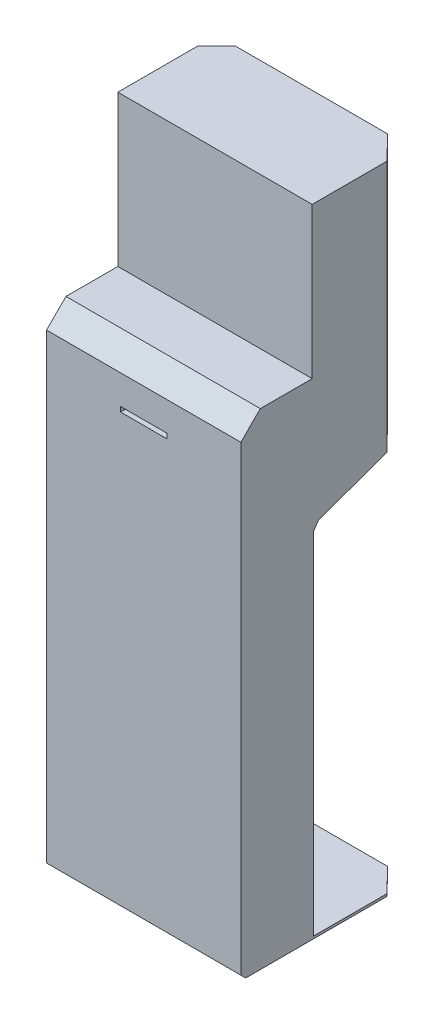
ISO-10303-21;
HEADER;
FILE_DESCRIPTION(('STEP AP214'),'2;1');
FILE_NAME('part.step','',(''),(''),'','','');
FILE_SCHEMA(('AUTOMOTIVE_DESIGN { 1 0 10303 214 1 1 1 1 }'));
ENDSEC;
DATA;
#1=APPLICATION_CONTEXT('core data for automotive mechanical design processes');
#2=APPLICATION_PROTOCOL_DEFINITION('international standard','automotive_design',2000,#1);
#3=PRODUCT_CONTEXT('',#1,'mechanical');
#4=PRODUCT('Part','Part','',(#3));
#5=PRODUCT_RELATED_PRODUCT_CATEGORY('part','',(#4));
#6=PRODUCT_DEFINITION_FORMATION('','',#4);
#7=PRODUCT_DEFINITION_CONTEXT('part definition',#1,'design');
#8=PRODUCT_DEFINITION('design','',#6,#7);
#9=PRODUCT_DEFINITION_SHAPE('','',#8);
#10=(LENGTH_UNIT() NAMED_UNIT(*) SI_UNIT(.MILLI.,.METRE.));
#11=(NAMED_UNIT(*) PLANE_ANGLE_UNIT() SI_UNIT($,.RADIAN.));
#12=(NAMED_UNIT(*) SI_UNIT($,.STERADIAN.) SOLID_ANGLE_UNIT());
#13=UNCERTAINTY_MEASURE_WITH_UNIT(LENGTH_MEASURE(1.E-05),#10,'distance_accuracy_value','');
#14=(GEOMETRIC_REPRESENTATION_CONTEXT(3) GLOBAL_UNCERTAINTY_ASSIGNED_CONTEXT((#13)) GLOBAL_UNIT_ASSIGNED_CONTEXT((#10,
#11,#12)) REPRESENTATION_CONTEXT('',''));
#15=CARTESIAN_POINT('',(0.,0.,0.));
#16=DIRECTION('',(0.,0.,1.));
#17=DIRECTION('',(1.,0.,0.));
#18=AXIS2_PLACEMENT_3D('',#15,#16,#17);
#19=CARTESIAN_POINT('',(400.,5.,0.));
#20=DIRECTION('',(0.,0.,1.));
#21=DIRECTION('',(0.,-1.,0.));
#22=AXIS2_PLACEMENT_3D('',#19,#20,#21);
#23=PLANE('',#22);
#24=DIRECTION('',(-1.,0.,0.));
#25=VECTOR('',#24,1.);
#26=CARTESIAN_POINT('',(400.,0.,0.));
#27=LINE('',#26,#25);
#28=CARTESIAN_POINT('',(351.734705208214,0.,0.));
#29=VERTEX_POINT('',#28);
#30=CARTESIAN_POINT('',(38.6420778551322,0.,0.));
#31=VERTEX_POINT('',#30);
#32=EDGE_CURVE('E287',#29,#31,#27,.T.);
#33=ORIENTED_EDGE('',*,*,#32,.T.);
#34=DIRECTION('',(0.,1.,0.));
#35=VECTOR('',#34,1.);
#36=CARTESIAN_POINT('',(38.6420778551322,5.00000000000004,0.));
#37=LINE('',#36,#35);
#38=CARTESIAN_POINT('',(38.6420778551322,5.,0.));
#39=VERTEX_POINT('',#38);
#40=EDGE_CURVE('E240',#31,#39,#37,.T.);
#41=ORIENTED_EDGE('',*,*,#40,.T.);
#42=DIRECTION('',(-1.,0.,0.));
#43=VECTOR('',#42,1.);
#44=CARTESIAN_POINT('',(400.,5.,0.));
#45=LINE('',#44,#43);
#46=CARTESIAN_POINT('',(351.734705208214,5.,0.));
#47=VERTEX_POINT('',#46);
#48=EDGE_CURVE('E349',#47,#39,#45,.T.);
#49=ORIENTED_EDGE('',*,*,#48,.F.);
#50=DIRECTION('',(0.,-1.,0.));
#51=VECTOR('',#50,1.);
#52=CARTESIAN_POINT('',(351.734705208214,4.99999999999999,0.));
#53=LINE('',#52,#51);
#54=EDGE_CURVE('E258',#47,#29,#53,.T.);
#55=ORIENTED_EDGE('',*,*,#54,.T.);
#56=EDGE_LOOP('',(#33,#41,#49,#55));
#57=FACE_BOUND('',#56,.T.);
#58=ADVANCED_FACE('F35',(#57),#23,.F.);
#59=CARTESIAN_POINT('',(400.,5.,200.));
#60=DIRECTION('',(0.,-1.,0.));
#61=DIRECTION('',(0.,0.,-1.));
#62=AXIS2_PLACEMENT_3D('',#59,#60,#61);
#63=PLANE('',#62);
#64=ORIENTED_EDGE('',*,*,#48,.T.);
#65=DIRECTION('',(-0.701254440401762,0.,0.712911081283502));
#66=VECTOR('',#65,1.);
#67=CARTESIAN_POINT('',(116.356238841946,5.,-79.0059689438939));
#68=LINE('',#67,#66);
#69=CARTESIAN_POINT('',(0.,5.,39.284407940377));
#70=VERTEX_POINT('',#69);
#71=EDGE_CURVE('E237',#39,#70,#68,.T.);
#72=ORIENTED_EDGE('',*,*,#71,.T.);
#73=DIRECTION('',(0.,0.,1.));
#74=VECTOR('',#73,1.);
#75=CARTESIAN_POINT('',(0.,5.,200.));
#76=LINE('',#75,#74);
#77=CARTESIAN_POINT('',(0.,5.,200.));
#78=VERTEX_POINT('',#77);
#79=EDGE_CURVE('E261',#70,#78,#76,.T.);
#80=ORIENTED_EDGE('',*,*,#79,.T.);
#81=DIRECTION('',(-1.,0.,0.));
#82=VECTOR('',#81,1.);
#83=CARTESIAN_POINT('',(400.,5.,200.));
#84=LINE('',#83,#82);
#85=CARTESIAN_POINT('',(400.,5.,200.));
#86=VERTEX_POINT('',#85);
#87=EDGE_CURVE('E346',#86,#78,#84,.T.);
#88=ORIENTED_EDGE('',*,*,#87,.F.);
#89=DIRECTION('',(0.,0.,1.));
#90=VECTOR('',#89,1.);
#91=CARTESIAN_POINT('',(400.,5.,200.));
#92=LINE('',#91,#90);
#93=CARTESIAN_POINT('',(400.,5.,49.0675873350135));
#94=VERTEX_POINT('',#93);
#95=EDGE_CURVE('E262',#94,#86,#92,.T.);
#96=ORIENTED_EDGE('',*,*,#95,.F.);
#97=DIRECTION('',(-0.701254440401762,0.,-0.712911081283502));
#98=VECTOR('',#97,1.);
#99=CARTESIAN_POINT('',(475.455952189898,5.,125.777810280849));
#100=LINE('',#99,#98);
#101=EDGE_CURVE('E255',#94,#47,#100,.T.);
#102=ORIENTED_EDGE('',*,*,#101,.T.);
#103=EDGE_LOOP('',(#64,#72,#80,#88,#96,#102));
#104=FACE_BOUND('',#103,.T.);
#105=ADVANCED_FACE('F401',(#104),#63,.F.);
#106=CARTESIAN_POINT('',(400.,727.20595314676,200.));
#107=DIRECTION('',(0.,0.,1.));
#108=DIRECTION('',(0.,-1.,0.));
#109=AXIS2_PLACEMENT_3D('',#106,#107,#108);
#110=PLANE('',#109);
#111=DIRECTION('',(0.,1.,0.));
#112=VECTOR('',#111,1.);
#113=CARTESIAN_POINT('',(0.,727.20595314676,200.));
#114=LINE('',#113,#112);
#115=CARTESIAN_POINT('',(0.,727.20595314676,200.));
#116=VERTEX_POINT('',#115);
#117=EDGE_CURVE('E289',#78,#116,#114,.T.);
#118=ORIENTED_EDGE('',*,*,#117,.T.);
#119=DIRECTION('',(-1.,0.,0.));
#120=VECTOR('',#119,1.);
#121=CARTESIAN_POINT('',(400.,727.20595314676,200.));
#122=LINE('',#121,#120);
#123=CARTESIAN_POINT('',(400.,727.20595314676,200.));
#124=VERTEX_POINT('',#123);
#125=EDGE_CURVE('E343',#124,#116,#122,.T.);
#126=ORIENTED_EDGE('',*,*,#125,.F.);
#127=DIRECTION('',(0.,1.,0.));
#128=VECTOR('',#127,1.);
#129=CARTESIAN_POINT('',(400.,727.20595314676,200.));
#130=LINE('',#129,#128);
#131=EDGE_CURVE('E264',#86,#124,#130,.T.);
#132=ORIENTED_EDGE('',*,*,#131,.F.);
#133=ORIENTED_EDGE('',*,*,#87,.T.);
#134=EDGE_LOOP('',(#118,#126,#132,#133));
#135=FACE_BOUND('',#134,.T.);
#136=ADVANCED_FACE('F409',(#135),#110,.F.);
#137=CARTESIAN_POINT('',(400.,740.626154580017,190.603073792141));
#138=DIRECTION('',(0.,0.573576436351043,0.819152044288994));
#139=DIRECTION('',(0.,-0.819152044288994,0.573576436351043));
#140=AXIS2_PLACEMENT_3D('',#137,#138,#139);
#141=PLANE('',#140);
#142=DIRECTION('',(0.,0.819152044288994,-0.573576436351043));
#143=VECTOR('',#142,1.);
#144=CARTESIAN_POINT('',(0.,740.626154580017,190.603073792141));
#145=LINE('',#144,#143);
#146=CARTESIAN_POINT('',(0.,740.626154580017,190.603073792141));
#147=VERTEX_POINT('',#146);
#148=EDGE_CURVE('E291',#116,#147,#145,.T.);
#149=ORIENTED_EDGE('',*,*,#148,.T.);
#150=DIRECTION('',(-1.,0.,0.));
#151=VECTOR('',#150,1.);
#152=CARTESIAN_POINT('',(400.,740.626154580017,190.603073792141));
#153=LINE('',#152,#151);
#154=CARTESIAN_POINT('',(400.,740.626154580017,190.603073792141));
#155=VERTEX_POINT('',#154);
#156=EDGE_CURVE('E340',#155,#147,#153,.T.);
#157=ORIENTED_EDGE('',*,*,#156,.F.);
#158=DIRECTION('',(0.,0.819152044288994,-0.573576436351043));
#159=VECTOR('',#158,1.);
#160=CARTESIAN_POINT('',(400.,740.626154580017,190.603073792141));
#161=LINE('',#160,#159);
#162=EDGE_CURVE('E267',#124,#155,#161,.T.);
#163=ORIENTED_EDGE('',*,*,#162,.F.);
#164=ORIENTED_EDGE('',*,*,#125,.T.);
#165=EDGE_LOOP('',(#149,#157,#163,#164));
#166=FACE_BOUND('',#165,.T.);
#167=ADVANCED_FACE('F414',(#166),#141,.F.);
#168=CARTESIAN_POINT('',(400.,806.579798566743,9.39692620785923));
#169=DIRECTION('',(0.,0.939692620785909,0.342020143325666));
#170=DIRECTION('',(0.,-0.342020143325666,0.93969262078591));
#171=AXIS2_PLACEMENT_3D('',#168,#169,#170);
#172=PLANE('',#171);
#173=DIRECTION('',(0.,0.342020143325666,-0.939692620785909));
#174=VECTOR('',#173,1.);
#175=CARTESIAN_POINT('',(0.,806.579798566743,9.39692620785923));
#176=LINE('',#175,#174);
#177=CARTESIAN_POINT('',(0.,795.701644838932,39.284407940377));
#178=VERTEX_POINT('',#177);
#179=EDGE_CURVE('E294',#147,#178,#176,.T.);
#180=ORIENTED_EDGE('',*,*,#179,.T.);
#181=DIRECTION('',(0.678775971324877,0.251160922277189,-0.69005896260598));
#182=VECTOR('',#181,1.);
#183=CARTESIAN_POINT('',(200.148417326644,869.760632209921,-164.190987569091));
#184=LINE('',#183,#182);
#185=CARTESIAN_POINT('',(29.3987985705331,806.579798566743,9.39692620785923));
#186=VERTEX_POINT('',#185);
#187=EDGE_CURVE('E225',#178,#186,#184,.T.);
#188=ORIENTED_EDGE('',*,*,#187,.T.);
#189=DIRECTION('',(-1.,0.,0.));
#190=VECTOR('',#189,1.);
#191=CARTESIAN_POINT('',(400.,806.579798566743,9.39692620785923));
#192=LINE('',#191,#190);
#193=CARTESIAN_POINT('',(360.977984492813,806.579798566743,9.39692620785923));
#194=VERTEX_POINT('',#193);
#195=EDGE_CURVE('E337',#194,#186,#192,.T.);
#196=ORIENTED_EDGE('',*,*,#195,.F.);
#197=DIRECTION('',(0.678775971324877,-0.251160922277189,0.69005896260598));
#198=VECTOR('',#197,1.);
#199=CARTESIAN_POINT('',(378.956863798241,799.927247358945,27.6746604330507));
#200=LINE('',#199,#198);
#201=CARTESIAN_POINT('',(400.,792.140858742798,49.0675873350135));
#202=VERTEX_POINT('',#201);
#203=EDGE_CURVE('E243',#194,#202,#200,.T.);
#204=ORIENTED_EDGE('',*,*,#203,.T.);
#205=DIRECTION('',(0.,0.342020143325666,-0.939692620785909));
#206=VECTOR('',#205,1.);
#207=CARTESIAN_POINT('',(400.,800.,27.4747741945468));
#208=LINE('',#207,#206);
#209=EDGE_CURVE('E269',#155,#202,#208,.T.);
#210=ORIENTED_EDGE('',*,*,#209,.F.);
#211=ORIENTED_EDGE('',*,*,#156,.T.);
#212=EDGE_LOOP('',(#180,#188,#196,#204,#210,#211));
#213=FACE_BOUND('',#212,.T.);
#214=ADVANCED_FACE('F416',(#213),#172,.F.);
#215=CARTESIAN_POINT('',(400.,820.,0.));
#216=DIRECTION('',(0.,0.57357643635105,0.819152044288989));
#217=DIRECTION('',(0.,-0.819152044288989,0.57357643635105));
#218=AXIS2_PLACEMENT_3D('',#215,#216,#217);
#219=PLANE('',#218);
#220=ORIENTED_EDGE('',*,*,#195,.T.);
#221=DIRECTION('',(0.491384255613947,0.713434646777101,-0.499552317693313));
#222=VECTOR('',#221,1.);
#223=CARTESIAN_POINT('',(125.895014880739,946.68144653791,-88.7033038171555));
#224=LINE('',#223,#222);
#225=CARTESIAN_POINT('',(38.6420778551321,820.,1.2490009027033E-13));
#226=VERTEX_POINT('',#225);
#227=EDGE_CURVE('E228',#186,#226,#224,.T.);
#228=ORIENTED_EDGE('',*,*,#227,.T.);
#229=DIRECTION('',(-1.,0.,0.));
#230=VECTOR('',#229,1.);
#231=CARTESIAN_POINT('',(400.,820.,0.));
#232=LINE('',#231,#230);
#233=CARTESIAN_POINT('',(351.734705208214,820.,0.));
#234=VERTEX_POINT('',#233);
#235=EDGE_CURVE('E334',#234,#226,#232,.T.);
#236=ORIENTED_EDGE('',*,*,#235,.F.);
#237=DIRECTION('',(0.491384255613947,-0.713434646777101,0.499552317693313));
#238=VECTOR('',#237,1.);
#239=CARTESIAN_POINT('',(363.388770247092,803.079608922062,11.8477853822285));
#240=LINE('',#239,#238);
#241=EDGE_CURVE('E246',#234,#194,#240,.T.);
#242=ORIENTED_EDGE('',*,*,#241,.T.);
#243=EDGE_LOOP('',(#220,#228,#236,#242));
#244=FACE_BOUND('',#243,.T.);
#245=ADVANCED_FACE('F421',(#244),#219,.F.);
#246=CARTESIAN_POINT('',(400.,1000.,0.));
#247=DIRECTION('',(0.,0.,1.));
#248=DIRECTION('',(0.,-1.,0.));
#249=AXIS2_PLACEMENT_3D('',#246,#247,#248);
#250=PLANE('',#249);
#251=ORIENTED_EDGE('',*,*,#235,.T.);
#252=DIRECTION('',(0.,1.,0.));
#253=VECTOR('',#252,1.);
#254=CARTESIAN_POINT('',(38.6420778551322,1000.,0.));
#255=LINE('',#254,#253);
#256=CARTESIAN_POINT('',(38.6420778551323,1310.69690242,0.));
#257=VERTEX_POINT('',#256);
#258=EDGE_CURVE('E231',#226,#257,#255,.T.);
#259=ORIENTED_EDGE('',*,*,#258,.T.);
#260=DIRECTION('',(-1.,0.,0.));
#261=VECTOR('',#260,1.);
#262=CARTESIAN_POINT('',(400.,1310.69690242,0.));
#263=LINE('',#262,#261);
#264=CARTESIAN_POINT('',(351.734705208214,1310.69690242,0.));
#265=VERTEX_POINT('',#264);
#266=EDGE_CURVE('E331',#265,#257,#263,.T.);
#267=ORIENTED_EDGE('',*,*,#266,.F.);
#268=DIRECTION('',(0.,-1.,0.));
#269=VECTOR('',#268,1.);
#270=CARTESIAN_POINT('',(351.734705208214,1000.,0.));
#271=LINE('',#270,#269);
#272=EDGE_CURVE('E249',#265,#234,#271,.T.);
#273=ORIENTED_EDGE('',*,*,#272,.T.);
#274=EDGE_LOOP('',(#251,#259,#267,#273));
#275=FACE_BOUND('',#274,.T.);
#276=ADVANCED_FACE('F423',(#275),#250,.F.);
#277=CARTESIAN_POINT('',(400.,1310.69690242,203.251091607901));
#278=DIRECTION('',(0.,-1.,0.));
#279=DIRECTION('',(0.,0.,-1.));
#280=AXIS2_PLACEMENT_3D('',#277,#278,#279);
#281=PLANE('',#280);
#282=ORIENTED_EDGE('',*,*,#266,.T.);
#283=DIRECTION('',(-0.701254440401762,0.,0.712911081283502));
#284=VECTOR('',#283,1.);
#285=CARTESIAN_POINT('',(-32.9719100035619,1310.69690242,72.804395349162));
#286=LINE('',#285,#284);
#287=CARTESIAN_POINT('',(0.,1310.69690242,39.284407940377));
#288=VERTEX_POINT('',#287);
#289=EDGE_CURVE('E222',#257,#288,#286,.T.);
#290=ORIENTED_EDGE('',*,*,#289,.T.);
#291=DIRECTION('',(0.,0.,1.));
#292=VECTOR('',#291,1.);
#293=CARTESIAN_POINT('',(0.,1310.69690242,203.251091607901));
#294=LINE('',#293,#292);
#295=CARTESIAN_POINT('',(0.,1310.69690242,203.251091607901));
#296=VERTEX_POINT('',#295);
#297=EDGE_CURVE('E297',#288,#296,#294,.T.);
#298=ORIENTED_EDGE('',*,*,#297,.T.);
#299=DIRECTION('',(-1.,0.,0.));
#300=VECTOR('',#299,1.);
#301=CARTESIAN_POINT('',(400.,1310.69690242,203.251091607901));
#302=LINE('',#301,#300);
#303=CARTESIAN_POINT('',(400.,1310.69690242,203.251091607901));
#304=VERTEX_POINT('',#303);
#305=EDGE_CURVE('E328',#304,#296,#302,.T.);
#306=ORIENTED_EDGE('',*,*,#305,.F.);
#307=DIRECTION('',(0.,0.,1.));
#308=VECTOR('',#307,1.);
#309=CARTESIAN_POINT('',(400.,1310.69690242,0.));
#310=LINE('',#309,#308);
#311=CARTESIAN_POINT('',(400.,1310.69690242,49.0675873350135));
#312=VERTEX_POINT('',#311);
#313=EDGE_CURVE('E272',#312,#304,#310,.T.);
#314=ORIENTED_EDGE('',*,*,#313,.F.);
#315=DIRECTION('',(-0.701254440401762,0.,-0.712911081283502));
#316=VECTOR('',#315,1.);
#317=CARTESIAN_POINT('',(322.648629758769,1310.69690242,-29.5695603539813));
#318=LINE('',#317,#316);
#319=EDGE_CURVE('E57',#312,#265,#318,.T.);
#320=ORIENTED_EDGE('',*,*,#319,.T.);
#321=EDGE_LOOP('',(#282,#290,#298,#306,#314,#320));
#322=FACE_BOUND('',#321,.T.);
#323=ADVANCED_FACE('F363',(#322),#281,.F.);
#324=CARTESIAN_POINT('',(400.,1000.,203.251091607901));
#325=DIRECTION('',(0.,0.,-1.));
#326=DIRECTION('',(-1.,0.,0.));
#327=AXIS2_PLACEMENT_3D('',#324,#325,#326);
#328=PLANE('',#327);
#329=DIRECTION('',(0.,-1.,0.));
#330=VECTOR('',#329,1.);
#331=CARTESIAN_POINT('',(0.,1000.,203.251091607901));
#332=LINE('',#331,#330);
#333=CARTESIAN_POINT('',(0.,1000.,203.251091607901));
#334=VERTEX_POINT('',#333);
#335=EDGE_CURVE('E299',#296,#334,#332,.T.);
#336=ORIENTED_EDGE('',*,*,#335,.T.);
#337=DIRECTION('',(-1.,0.,0.));
#338=VECTOR('',#337,1.);
#339=CARTESIAN_POINT('',(400.,1000.,203.251091607901));
#340=LINE('',#339,#338);
#341=CARTESIAN_POINT('',(400.,1000.,203.251091607901));
#342=VERTEX_POINT('',#341);
#343=EDGE_CURVE('E325',#342,#334,#340,.T.);
#344=ORIENTED_EDGE('',*,*,#343,.F.);
#345=DIRECTION('',(0.,-1.,0.));
#346=VECTOR('',#345,1.);
#347=CARTESIAN_POINT('',(400.,1000.,203.251091607901));
#348=LINE('',#347,#346);
#349=EDGE_CURVE('E274',#304,#342,#348,.T.);
#350=ORIENTED_EDGE('',*,*,#349,.F.);
#351=ORIENTED_EDGE('',*,*,#305,.T.);
#352=EDGE_LOOP('',(#336,#344,#350,#351));
#353=FACE_BOUND('',#352,.T.);
#354=ADVANCED_FACE('F370',(#353),#328,.F.);
#355=CARTESIAN_POINT('',(400.,1000.,310.));
#356=DIRECTION('',(0.,-1.,0.));
#357=DIRECTION('',(0.,0.,-1.));
#358=AXIS2_PLACEMENT_3D('',#355,#356,#357);
#359=PLANE('',#358);
#360=DIRECTION('',(0.,0.,1.));
#361=VECTOR('',#360,1.);
#362=CARTESIAN_POINT('',(0.,1000.,310.));
#363=LINE('',#362,#361);
#364=CARTESIAN_POINT('',(0.,1000.,310.));
#365=VERTEX_POINT('',#364);
#366=EDGE_CURVE('E301',#334,#365,#363,.T.);
#367=ORIENTED_EDGE('',*,*,#366,.T.);
#368=DIRECTION('',(-1.,0.,0.));
#369=VECTOR('',#368,1.);
#370=CARTESIAN_POINT('',(400.,1000.,310.));
#371=LINE('',#370,#369);
#372=CARTESIAN_POINT('',(400.,1000.,310.));
#373=VERTEX_POINT('',#372);
#374=EDGE_CURVE('E322',#373,#365,#371,.T.);
#375=ORIENTED_EDGE('',*,*,#374,.F.);
#376=DIRECTION('',(0.,0.,1.));
#377=VECTOR('',#376,1.);
#378=CARTESIAN_POINT('',(400.,1000.,310.));
#379=LINE('',#378,#377);
#380=EDGE_CURVE('E276',#342,#373,#379,.T.);
#381=ORIENTED_EDGE('',*,*,#380,.F.);
#382=ORIENTED_EDGE('',*,*,#343,.T.);
#383=EDGE_LOOP('',(#367,#375,#381,#382));
#384=FACE_BOUND('',#383,.T.);
#385=ADVANCED_FACE('F376',(#384),#359,.F.);
#386=CARTESIAN_POINT('',(400.,1000.,310.));
#387=DIRECTION('',(0.,-0.707106781186547,-0.707106781186547));
#388=DIRECTION('',(0.,0.707106781186548,-0.707106781186548));
#389=AXIS2_PLACEMENT_3D('',#386,#387,#388);
#390=PLANE('',#389);
#391=DIRECTION('',(0.,-0.707106781186547,0.707106781186547));
#392=VECTOR('',#391,1.);
#393=CARTESIAN_POINT('',(0.,1000.,310.));
#394=LINE('',#393,#392);
#395=CARTESIAN_POINT('',(0.,960.,350.));
#396=VERTEX_POINT('',#395);
#397=EDGE_CURVE('E303',#365,#396,#394,.T.);
#398=ORIENTED_EDGE('',*,*,#397,.T.);
#399=DIRECTION('',(-1.,0.,0.));
#400=VECTOR('',#399,1.);
#401=CARTESIAN_POINT('',(400.,960.,350.));
#402=LINE('',#401,#400);
#403=CARTESIAN_POINT('',(400.,960.,350.));
#404=VERTEX_POINT('',#403);
#405=EDGE_CURVE('E319',#404,#396,#402,.T.);
#406=ORIENTED_EDGE('',*,*,#405,.F.);
#407=DIRECTION('',(0.,-0.707106781186547,0.707106781186547));
#408=VECTOR('',#407,1.);
#409=CARTESIAN_POINT('',(400.,1000.,310.));
#410=LINE('',#409,#408);
#411=EDGE_CURVE('E278',#373,#404,#410,.T.);
#412=ORIENTED_EDGE('',*,*,#411,.F.);
#413=ORIENTED_EDGE('',*,*,#374,.T.);
#414=EDGE_LOOP('',(#398,#406,#412,#413));
#415=FACE_BOUND('',#414,.T.);
#416=ADVANCED_FACE('F380',(#415),#390,.F.);
#417=CARTESIAN_POINT('',(400.,9.99999999999996,350.));
#418=DIRECTION('',(0.,0.,-1.));
#419=DIRECTION('',(0.,1.,0.));
#420=AXIS2_PLACEMENT_3D('',#417,#418,#419);
#421=PLANE('',#420);
#422=DIRECTION('',(1.,0.,0.));
#423=VECTOR('',#422,1.);
#424=CARTESIAN_POINT('',(152.5,890.,350.));
#425=LINE('',#424,#423);
#426=CARTESIAN_POINT('',(152.5,890.,350.));
#427=VERTEX_POINT('',#426);
#428=CARTESIAN_POINT('',(247.5,890.,350.));
#429=VERTEX_POINT('',#428);
#430=EDGE_CURVE('E212',#427,#429,#425,.T.);
#431=ORIENTED_EDGE('',*,*,#430,.F.);
#432=DIRECTION('',(0.,-1.,0.));
#433=VECTOR('',#432,1.);
#434=CARTESIAN_POINT('',(152.5,900.,350.));
#435=LINE('',#434,#433);
#436=CARTESIAN_POINT('',(152.5,900.,350.));
#437=VERTEX_POINT('',#436);
#438=EDGE_CURVE('E49',#437,#427,#435,.T.);
#439=ORIENTED_EDGE('',*,*,#438,.F.);
#440=DIRECTION('',(-1.,0.,0.));
#441=VECTOR('',#440,1.);
#442=CARTESIAN_POINT('',(152.5,900.,350.));
#443=LINE('',#442,#441);
#444=CARTESIAN_POINT('',(247.5,900.,350.));
#445=VERTEX_POINT('',#444);
#446=EDGE_CURVE('E203',#445,#437,#443,.T.);
#447=ORIENTED_EDGE('',*,*,#446,.F.);
#448=DIRECTION('',(0.,1.,0.));
#449=VECTOR('',#448,1.);
#450=CARTESIAN_POINT('',(247.5,900.,350.));
#451=LINE('',#450,#449);
#452=EDGE_CURVE('E206',#429,#445,#451,.T.);
#453=ORIENTED_EDGE('',*,*,#452,.F.);
#454=EDGE_LOOP('',(#431,#439,#447,#453));
#455=FACE_BOUND('',#454,.T.);
#456=DIRECTION('',(0.,-1.,0.));
#457=VECTOR('',#456,1.);
#458=CARTESIAN_POINT('',(0.,9.99999999999996,350.));
#459=LINE('',#458,#457);
#460=CARTESIAN_POINT('',(0.,9.99999999999996,350.));
#461=VERTEX_POINT('',#460);
#462=EDGE_CURVE('E305',#396,#461,#459,.T.);
#463=ORIENTED_EDGE('',*,*,#462,.T.);
#464=DIRECTION('',(-1.,0.,0.));
#465=VECTOR('',#464,1.);
#466=CARTESIAN_POINT('',(400.,9.99999999999996,350.));
#467=LINE('',#466,#465);
#468=CARTESIAN_POINT('',(400.,9.99999999999996,350.));
#469=VERTEX_POINT('',#468);
#470=EDGE_CURVE('E316',#469,#461,#467,.T.);
#471=ORIENTED_EDGE('',*,*,#470,.F.);
#472=DIRECTION('',(0.,-1.,0.));
#473=VECTOR('',#472,1.);
#474=CARTESIAN_POINT('',(400.,9.99999999999996,350.));
#475=LINE('',#474,#473);
#476=EDGE_CURVE('E280',#404,#469,#475,.T.);
#477=ORIENTED_EDGE('',*,*,#476,.F.);
#478=ORIENTED_EDGE('',*,*,#405,.T.);
#479=EDGE_LOOP('',(#463,#471,#477,#478));
#480=FACE_BOUND('',#479,.T.);
#481=ADVANCED_FACE('F385',(#455,#480),#421,.F.);
#482=CARTESIAN_POINT('',(400.,0.,340.));
#483=DIRECTION('',(0.,0.707106781186548,-0.707106781186547));
#484=DIRECTION('',(0.,0.707106781186547,0.707106781186548));
#485=AXIS2_PLACEMENT_3D('',#482,#483,#484);
#486=PLANE('',#485);
#487=DIRECTION('',(0.,-0.707106781186547,-0.707106781186548));
#488=VECTOR('',#487,1.);
#489=CARTESIAN_POINT('',(0.,0.,340.));
#490=LINE('',#489,#488);
#491=CARTESIAN_POINT('',(0.,0.,340.));
#492=VERTEX_POINT('',#491);
#493=EDGE_CURVE('E307',#461,#492,#490,.T.);
#494=ORIENTED_EDGE('',*,*,#493,.T.);
#495=DIRECTION('',(-1.,0.,0.));
#496=VECTOR('',#495,1.);
#497=CARTESIAN_POINT('',(400.,0.,340.));
#498=LINE('',#497,#496);
#499=CARTESIAN_POINT('',(400.,0.,340.));
#500=VERTEX_POINT('',#499);
#501=EDGE_CURVE('E313',#500,#492,#498,.T.);
#502=ORIENTED_EDGE('',*,*,#501,.F.);
#503=DIRECTION('',(0.,-0.707106781186547,-0.707106781186548));
#504=VECTOR('',#503,1.);
#505=CARTESIAN_POINT('',(400.,0.,340.));
#506=LINE('',#505,#504);
#507=EDGE_CURVE('E282',#469,#500,#506,.T.);
#508=ORIENTED_EDGE('',*,*,#507,.F.);
#509=ORIENTED_EDGE('',*,*,#470,.T.);
#510=EDGE_LOOP('',(#494,#502,#508,#509));
#511=FACE_BOUND('',#510,.T.);
#512=ADVANCED_FACE('F390',(#511),#486,.F.);
#513=CARTESIAN_POINT('',(400.,0.,0.));
#514=DIRECTION('',(0.,1.,0.));
#515=DIRECTION('',(0.,0.,1.));
#516=AXIS2_PLACEMENT_3D('',#513,#514,#515);
#517=PLANE('',#516);
#518=DIRECTION('',(0.,0.,-1.));
#519=VECTOR('',#518,1.);
#520=CARTESIAN_POINT('',(0.,0.,0.));
#521=LINE('',#520,#519);
#522=CARTESIAN_POINT('',(0.,0.,39.284407940377));
#523=VERTEX_POINT('',#522);
#524=EDGE_CURVE('E265',#492,#523,#521,.T.);
#525=ORIENTED_EDGE('',*,*,#524,.T.);
#526=DIRECTION('',(0.701254440401762,0.,-0.712911081283502));
#527=VECTOR('',#526,1.);
#528=CARTESIAN_POINT('',(216.342651114281,0.,-180.654410907256));
#529=LINE('',#528,#527);
#530=EDGE_CURVE('E234',#523,#31,#529,.T.);
#531=ORIENTED_EDGE('',*,*,#530,.T.);
#532=ORIENTED_EDGE('',*,*,#32,.F.);
#533=DIRECTION('',(0.701254440401762,0.,0.712911081283502));
#534=VECTOR('',#533,1.);
#535=CARTESIAN_POINT('',(375.469539917563,0.,24.1293683174868));
#536=LINE('',#535,#534);
#537=CARTESIAN_POINT('',(400.,0.,49.0675873350135));
#538=VERTEX_POINT('',#537);
#539=EDGE_CURVE('E252',#29,#538,#536,.T.);
#540=ORIENTED_EDGE('',*,*,#539,.T.);
#541=DIRECTION('',(0.,0.,-1.));
#542=VECTOR('',#541,1.);
#543=CARTESIAN_POINT('',(400.,0.,0.));
#544=LINE('',#543,#542);
#545=EDGE_CURVE('E284',#500,#538,#544,.T.);
#546=ORIENTED_EDGE('',*,*,#545,.F.);
#547=ORIENTED_EDGE('',*,*,#501,.T.);
#548=EDGE_LOOP('',(#525,#531,#532,#540,#546,#547));
#549=FACE_BOUND('',#548,.T.);
#550=ADVANCED_FACE('F394',(#549),#517,.F.);
#551=CARTESIAN_POINT('',(400.,0.,0.));
#552=DIRECTION('',(-1.,0.,0.));
#553=DIRECTION('',(0.,0.,1.));
#554=AXIS2_PLACEMENT_3D('',#551,#552,#553);
#555=PLANE('',#554);
#556=ORIENTED_EDGE('',*,*,#545,.T.);
#557=DIRECTION('',(0.,1.,0.));
#558=VECTOR('',#557,1.);
#559=CARTESIAN_POINT('',(400.,0.,49.0675873350135));
#560=LINE('',#559,#558);
#561=EDGE_CURVE('E11',#538,#94,#560,.T.);
#562=ORIENTED_EDGE('',*,*,#561,.T.);
#563=ORIENTED_EDGE('',*,*,#95,.T.);
#564=ORIENTED_EDGE('',*,*,#131,.T.);
#565=ORIENTED_EDGE('',*,*,#162,.T.);
#566=ORIENTED_EDGE('',*,*,#209,.T.);
#567=EDGE_CURVE('E38',#202,#312,#560,.T.);
#568=ORIENTED_EDGE('',*,*,#567,.T.);
#569=ORIENTED_EDGE('',*,*,#313,.T.);
#570=ORIENTED_EDGE('',*,*,#349,.T.);
#571=ORIENTED_EDGE('',*,*,#380,.T.);
#572=ORIENTED_EDGE('',*,*,#411,.T.);
#573=ORIENTED_EDGE('',*,*,#476,.T.);
#574=ORIENTED_EDGE('',*,*,#507,.T.);
#575=EDGE_LOOP('',(#556,#562,#563,#564,#565,#566,#568,#569,#570,#571,#572,#573,#574));
#576=FACE_BOUND('',#575,.T.);
#577=ADVANCED_FACE('F359',(#576),#555,.F.);
#578=CARTESIAN_POINT('',(0.,0.,0.));
#579=DIRECTION('',(-1.,0.,0.));
#580=DIRECTION('',(0.,0.,1.));
#581=AXIS2_PLACEMENT_3D('',#578,#579,#580);
#582=PLANE('',#581);
#583=DIRECTION('',(0.,1.,0.));
#584=VECTOR('',#583,1.);
#585=CARTESIAN_POINT('',(0.,0.,39.284407940377));
#586=LINE('',#585,#584);
#587=EDGE_CURVE('E352',#523,#70,#586,.T.);
#588=ORIENTED_EDGE('',*,*,#587,.F.);
#589=ORIENTED_EDGE('',*,*,#524,.F.);
#590=ORIENTED_EDGE('',*,*,#493,.F.);
#591=ORIENTED_EDGE('',*,*,#462,.F.);
#592=ORIENTED_EDGE('',*,*,#397,.F.);
#593=ORIENTED_EDGE('',*,*,#366,.F.);
#594=ORIENTED_EDGE('',*,*,#335,.F.);
#595=ORIENTED_EDGE('',*,*,#297,.F.);
#596=EDGE_CURVE('E351',#178,#288,#586,.T.);
#597=ORIENTED_EDGE('',*,*,#596,.F.);
#598=ORIENTED_EDGE('',*,*,#179,.F.);
#599=ORIENTED_EDGE('',*,*,#148,.F.);
#600=ORIENTED_EDGE('',*,*,#117,.F.);
#601=ORIENTED_EDGE('',*,*,#79,.F.);
#602=EDGE_LOOP('',(#588,#589,#590,#591,#592,#593,#594,#595,#597,#598,#599,#600,#601));
#603=FACE_BOUND('',#602,.T.);
#604=ADVANCED_FACE('F425',(#603),#582,.T.);
#605=CARTESIAN_POINT('',(-32.9719100035619,1310.69690242,72.804395349162));
#606=DIRECTION('',(0.712911081283502,0.,0.701254440401762));
#607=DIRECTION('',(0.701254440401762,0.,-0.712911081283502));
#608=AXIS2_PLACEMENT_3D('',#605,#606,#607);
#609=PLANE('',#608);
#610=ORIENTED_EDGE('',*,*,#227,.F.);
#611=ORIENTED_EDGE('',*,*,#187,.F.);
#612=ORIENTED_EDGE('',*,*,#596,.T.);
#613=ORIENTED_EDGE('',*,*,#289,.F.);
#614=ORIENTED_EDGE('',*,*,#258,.F.);
#615=EDGE_LOOP('',(#610,#611,#612,#613,#614));
#616=FACE_BOUND('',#615,.T.);
#617=ADVANCED_FACE('F428',(#616),#609,.F.);
#618=ORIENTED_EDGE('',*,*,#530,.F.);
#619=ORIENTED_EDGE('',*,*,#587,.T.);
#620=ORIENTED_EDGE('',*,*,#71,.F.);
#621=ORIENTED_EDGE('',*,*,#40,.F.);
#622=EDGE_LOOP('',(#618,#619,#620,#621));
#623=FACE_BOUND('',#622,.T.);
#624=ADVANCED_FACE('F426',(#623),#609,.F.);
#625=CARTESIAN_POINT('',(322.648629758769,1310.69690242,-29.5695603539813));
#626=DIRECTION('',(-0.712911081283502,0.,0.701254440401762));
#627=DIRECTION('',(0.701254440401762,0.,0.712911081283502));
#628=AXIS2_PLACEMENT_3D('',#625,#626,#627);
#629=PLANE('',#628);
#630=ORIENTED_EDGE('',*,*,#319,.F.);
#631=ORIENTED_EDGE('',*,*,#567,.F.);
#632=ORIENTED_EDGE('',*,*,#203,.F.);
#633=ORIENTED_EDGE('',*,*,#241,.F.);
#634=ORIENTED_EDGE('',*,*,#272,.F.);
#635=EDGE_LOOP('',(#630,#631,#632,#633,#634));
#636=FACE_BOUND('',#635,.T.);
#637=ADVANCED_FACE('F418',(#636),#629,.F.);
#638=ORIENTED_EDGE('',*,*,#101,.F.);
#639=ORIENTED_EDGE('',*,*,#561,.F.);
#640=ORIENTED_EDGE('',*,*,#539,.F.);
#641=ORIENTED_EDGE('',*,*,#54,.F.);
#642=EDGE_LOOP('',(#638,#639,#640,#641));
#643=FACE_BOUND('',#642,.T.);
#644=ADVANCED_FACE('F397',(#643),#629,.F.);
#645=CARTESIAN_POINT('',(152.5,900.,241.));
#646=DIRECTION('',(-1.,0.,0.));
#647=DIRECTION('',(0.,0.,1.));
#648=AXIS2_PLACEMENT_3D('',#645,#646,#647);
#649=PLANE('',#648);
#650=ORIENTED_EDGE('',*,*,#438,.T.);
#651=DIRECTION('',(0.,0.,1.));
#652=VECTOR('',#651,1.);
#653=CARTESIAN_POINT('',(152.5,890.,241.));
#654=LINE('',#653,#652);
#655=CARTESIAN_POINT('',(152.5,890.,241.));
#656=VERTEX_POINT('',#655);
#657=EDGE_CURVE('E181',#656,#427,#654,.T.);
#658=ORIENTED_EDGE('',*,*,#657,.F.);
#659=DIRECTION('',(0.,-1.,0.));
#660=VECTOR('',#659,1.);
#661=CARTESIAN_POINT('',(152.5,900.,241.));
#662=LINE('',#661,#660);
#663=CARTESIAN_POINT('',(152.5,900.,241.));
#664=VERTEX_POINT('',#663);
#665=EDGE_CURVE('E185',#664,#656,#662,.T.);
#666=ORIENTED_EDGE('',*,*,#665,.F.);
#667=DIRECTION('',(0.,0.,1.));
#668=VECTOR('',#667,1.);
#669=CARTESIAN_POINT('',(152.5,900.,241.));
#670=LINE('',#669,#668);
#671=EDGE_CURVE('E216',#664,#437,#670,.T.);
#672=ORIENTED_EDGE('',*,*,#671,.T.);
#673=EDGE_LOOP('',(#650,#658,#666,#672));
#674=FACE_BOUND('',#673,.T.);
#675=ADVANCED_FACE('F183',(#674),#649,.F.);
#676=CARTESIAN_POINT('',(152.5,900.,241.));
#677=DIRECTION('',(0.,1.,0.));
#678=DIRECTION('',(0.,0.,1.));
#679=AXIS2_PLACEMENT_3D('',#676,#677,#678);
#680=PLANE('',#679);
#681=ORIENTED_EDGE('',*,*,#446,.T.);
#682=ORIENTED_EDGE('',*,*,#671,.F.);
#683=DIRECTION('',(-1.,0.,0.));
#684=VECTOR('',#683,1.);
#685=CARTESIAN_POINT('',(152.5,900.,241.));
#686=LINE('',#685,#684);
#687=CARTESIAN_POINT('',(247.5,900.,241.));
#688=VERTEX_POINT('',#687);
#689=EDGE_CURVE('E191',#688,#664,#686,.T.);
#690=ORIENTED_EDGE('',*,*,#689,.F.);
#691=DIRECTION('',(0.,0.,1.));
#692=VECTOR('',#691,1.);
#693=CARTESIAN_POINT('',(247.5,900.,241.));
#694=LINE('',#693,#692);
#695=EDGE_CURVE('E218',#688,#445,#694,.T.);
#696=ORIENTED_EDGE('',*,*,#695,.T.);
#697=EDGE_LOOP('',(#681,#682,#690,#696));
#698=FACE_BOUND('',#697,.T.);
#699=ADVANCED_FACE('F475',(#698),#680,.F.);
#700=CARTESIAN_POINT('',(247.5,900.,241.));
#701=DIRECTION('',(1.,0.,0.));
#702=DIRECTION('',(0.,1.,0.));
#703=AXIS2_PLACEMENT_3D('',#700,#701,#702);
#704=PLANE('',#703);
#705=ORIENTED_EDGE('',*,*,#452,.T.);
#706=ORIENTED_EDGE('',*,*,#695,.F.);
#707=DIRECTION('',(0.,1.,0.));
#708=VECTOR('',#707,1.);
#709=CARTESIAN_POINT('',(247.5,900.,241.));
#710=LINE('',#709,#708);
#711=CARTESIAN_POINT('',(247.5,890.,241.));
#712=VERTEX_POINT('',#711);
#713=EDGE_CURVE('E199',#712,#688,#710,.T.);
#714=ORIENTED_EDGE('',*,*,#713,.F.);
#715=DIRECTION('',(0.,0.,1.));
#716=VECTOR('',#715,1.);
#717=CARTESIAN_POINT('',(247.5,890.,241.));
#718=LINE('',#717,#716);
#719=EDGE_CURVE('E190',#712,#429,#718,.T.);
#720=ORIENTED_EDGE('',*,*,#719,.T.);
#721=EDGE_LOOP('',(#705,#706,#714,#720));
#722=FACE_BOUND('',#721,.T.);
#723=ADVANCED_FACE('F479',(#722),#704,.F.);
#724=CARTESIAN_POINT('',(152.5,890.,241.));
#725=DIRECTION('',(0.,-1.,0.));
#726=DIRECTION('',(0.,0.,-1.));
#727=AXIS2_PLACEMENT_3D('',#724,#725,#726);
#728=PLANE('',#727);
#729=ORIENTED_EDGE('',*,*,#430,.T.);
#730=ORIENTED_EDGE('',*,*,#719,.F.);
#731=DIRECTION('',(1.,0.,0.));
#732=VECTOR('',#731,1.);
#733=CARTESIAN_POINT('',(152.5,890.,241.));
#734=LINE('',#733,#732);
#735=EDGE_CURVE('E194',#656,#712,#734,.T.);
#736=ORIENTED_EDGE('',*,*,#735,.F.);
#737=ORIENTED_EDGE('',*,*,#657,.T.);
#738=EDGE_LOOP('',(#729,#730,#736,#737));
#739=FACE_BOUND('',#738,.T.);
#740=ADVANCED_FACE('F195',(#739),#728,.F.);
#741=CARTESIAN_POINT('',(0.,0.,241.));
#742=DIRECTION('',(0.,0.,1.));
#743=DIRECTION('',(1.,0.,0.));
#744=AXIS2_PLACEMENT_3D('',#741,#742,#743);
#745=PLANE('',#744);
#746=ORIENTED_EDGE('',*,*,#665,.T.);
#747=ORIENTED_EDGE('',*,*,#735,.T.);
#748=ORIENTED_EDGE('',*,*,#713,.T.);
#749=ORIENTED_EDGE('',*,*,#689,.T.);
#750=EDGE_LOOP('',(#746,#747,#748,#749));
#751=FACE_BOUND('',#750,.T.);
#752=ADVANCED_FACE('F201',(#751),#745,.T.);
#753=CLOSED_SHELL('',(#58,#105,#136,#167,#214,#245,#276,#323,#354,#385,#416,#481,#512,#550,#577,
#604,#617,#624,#637,#644,#675,#699,#723,#740,#752));
#754=MANIFOLD_SOLID_BREP('B2',#753);
#755=ADVANCED_BREP_SHAPE_REPRESENTATION('',(#18,#754),#14);
#756=SHAPE_DEFINITION_REPRESENTATION(#9,#755);
ENDSEC;
END-ISO-10303-21;
